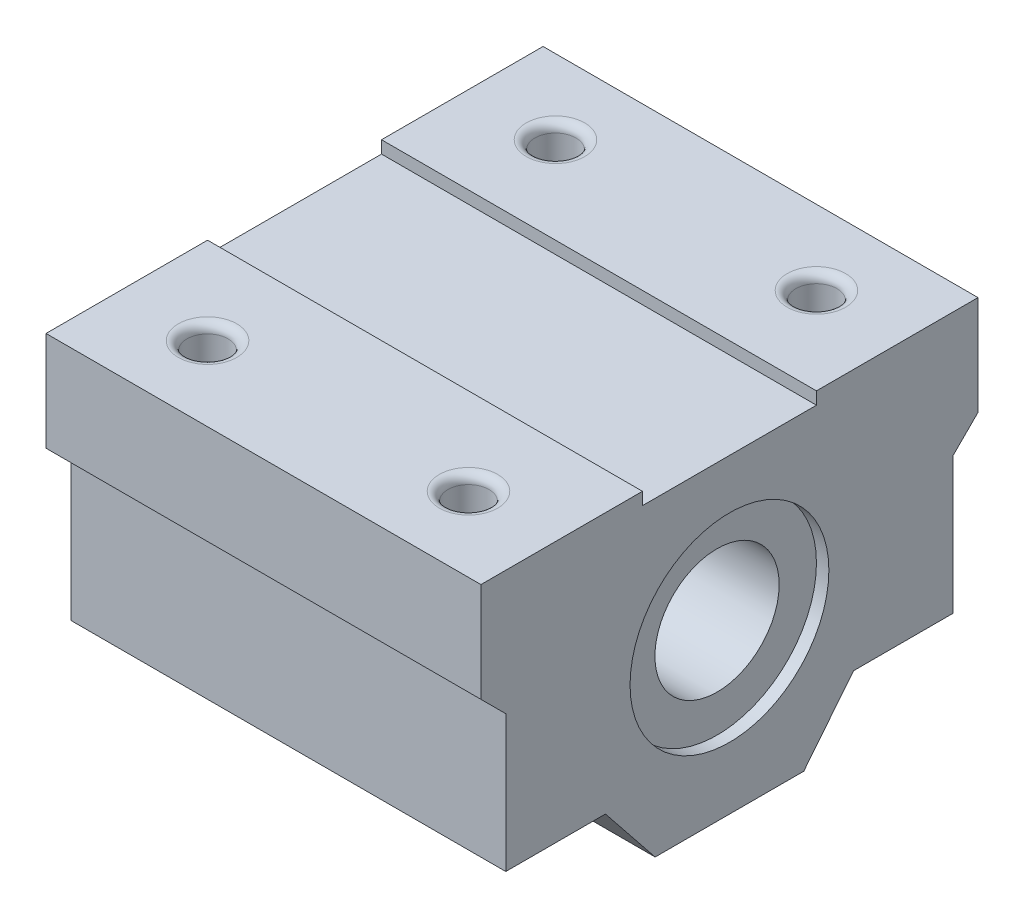
ISO-10303-21;
HEADER;
FILE_DESCRIPTION(('STEP AP214'),'2;1');
FILE_NAME('part.step','',(''),(''),'','','');
FILE_SCHEMA(('AUTOMOTIVE_DESIGN { 1 0 10303 214 1 1 1 1 }'));
ENDSEC;
DATA;
#1=APPLICATION_CONTEXT('core data for automotive mechanical design processes');
#2=APPLICATION_PROTOCOL_DEFINITION('international standard','automotive_design',2000,#1);
#3=PRODUCT_CONTEXT('',#1,'mechanical');
#4=PRODUCT('Part','Part','',(#3));
#5=PRODUCT_RELATED_PRODUCT_CATEGORY('part','',(#4));
#6=PRODUCT_DEFINITION_FORMATION('','',#4);
#7=PRODUCT_DEFINITION_CONTEXT('part definition',#1,'design');
#8=PRODUCT_DEFINITION('design','',#6,#7);
#9=PRODUCT_DEFINITION_SHAPE('','',#8);
#10=(LENGTH_UNIT() NAMED_UNIT(*) SI_UNIT(.MILLI.,.METRE.));
#11=(NAMED_UNIT(*) PLANE_ANGLE_UNIT() SI_UNIT($,.RADIAN.));
#12=(NAMED_UNIT(*) SI_UNIT($,.STERADIAN.) SOLID_ANGLE_UNIT());
#13=UNCERTAINTY_MEASURE_WITH_UNIT(LENGTH_MEASURE(1.E-05),#10,'distance_accuracy_value','');
#14=(GEOMETRIC_REPRESENTATION_CONTEXT(3) GLOBAL_UNCERTAINTY_ASSIGNED_CONTEXT((#13)) GLOBAL_UNIT_ASSIGNED_CONTEXT((#10,
#11,#12)) REPRESENTATION_CONTEXT('',''));
#15=CARTESIAN_POINT('',(0.,0.,0.));
#16=DIRECTION('',(0.,0.,1.));
#17=DIRECTION('',(1.,0.,0.));
#18=AXIS2_PLACEMENT_3D('',#15,#16,#17);
#19=CARTESIAN_POINT('',(-17.5,13.,0.));
#20=DIRECTION('',(1.,0.,0.));
#21=DIRECTION('',(0.,0.,-1.));
#22=AXIS2_PLACEMENT_3D('',#19,#20,#21);
#23=CYLINDRICAL_SURFACE('',#22,5.);
#24=CARTESIAN_POINT('',(16.5,13.,0.));
#25=DIRECTION('',(1.,0.,0.));
#26=DIRECTION('',(0.,0.,-1.));
#27=AXIS2_PLACEMENT_3D('',#24,#25,#26);
#28=CIRCLE('',#27,5.);
#29=CARTESIAN_POINT('',(16.5,13.,-4.99999999999999));
#30=VERTEX_POINT('',#29);
#31=EDGE_CURVE('E271',#30,#30,#28,.F.);
#32=ORIENTED_EDGE('',*,*,#31,.F.);
#33=EDGE_LOOP('',(#32));
#34=FACE_BOUND('',#33,.T.);
#35=CARTESIAN_POINT('',(-16.5,13.,0.));
#36=DIRECTION('',(-1.,0.,0.));
#37=DIRECTION('',(0.,0.,1.));
#38=AXIS2_PLACEMENT_3D('',#35,#36,#37);
#39=CIRCLE('',#38,5.);
#40=CARTESIAN_POINT('',(-16.5,13.,5.00000000000001));
#41=VERTEX_POINT('',#40);
#42=EDGE_CURVE('E38',#41,#41,#39,.F.);
#43=ORIENTED_EDGE('',*,*,#42,.F.);
#44=EDGE_LOOP('',(#43));
#45=FACE_BOUND('',#44,.T.);
#46=ADVANCED_FACE('F34',(#34,#45),#23,.F.);
#47=CARTESIAN_POINT('',(17.5,18.,20.));
#48=DIRECTION('',(0.,0.,-1.));
#49=DIRECTION('',(0.,1.,0.));
#50=AXIS2_PLACEMENT_3D('',#47,#48,#49);
#51=PLANE('',#50);
#52=DIRECTION('',(0.,-1.,0.));
#53=VECTOR('',#52,1.);
#54=CARTESIAN_POINT('',(-17.5,18.,20.));
#55=LINE('',#54,#53);
#56=CARTESIAN_POINT('',(-17.5,26.,20.));
#57=VERTEX_POINT('',#56);
#58=CARTESIAN_POINT('',(-17.5,18.,20.));
#59=VERTEX_POINT('',#58);
#60=EDGE_CURVE('E182',#57,#59,#55,.T.);
#61=ORIENTED_EDGE('',*,*,#60,.T.);
#62=DIRECTION('',(-1.,0.,0.));
#63=VECTOR('',#62,1.);
#64=CARTESIAN_POINT('',(17.5,18.,20.));
#65=LINE('',#64,#63);
#66=CARTESIAN_POINT('',(17.5,18.,20.));
#67=VERTEX_POINT('',#66);
#68=EDGE_CURVE('E250',#67,#59,#65,.T.);
#69=ORIENTED_EDGE('',*,*,#68,.F.);
#70=DIRECTION('',(0.,-1.,0.));
#71=VECTOR('',#70,1.);
#72=CARTESIAN_POINT('',(17.5,18.,20.));
#73=LINE('',#72,#71);
#74=CARTESIAN_POINT('',(17.5,26.,20.));
#75=VERTEX_POINT('',#74);
#76=EDGE_CURVE('E213',#75,#67,#73,.T.);
#77=ORIENTED_EDGE('',*,*,#76,.F.);
#78=DIRECTION('',(-1.,0.,0.));
#79=VECTOR('',#78,1.);
#80=CARTESIAN_POINT('',(17.5,26.,20.));
#81=LINE('',#80,#79);
#82=EDGE_CURVE('E178',#75,#57,#81,.T.);
#83=ORIENTED_EDGE('',*,*,#82,.T.);
#84=EDGE_LOOP('',(#61,#69,#77,#83));
#85=FACE_BOUND('',#84,.T.);
#86=ADVANCED_FACE('F335',(#85),#51,.F.);
#87=CARTESIAN_POINT('',(17.5,16.,18.));
#88=DIRECTION('',(0.,0.707106781186548,-0.707106781186548));
#89=DIRECTION('',(0.,0.707106781186548,0.707106781186548));
#90=AXIS2_PLACEMENT_3D('',#87,#88,#89);
#91=PLANE('',#90);
#92=DIRECTION('',(0.,-0.707106781186547,-0.707106781186547));
#93=VECTOR('',#92,1.);
#94=CARTESIAN_POINT('',(-17.5,16.,18.));
#95=LINE('',#94,#93);
#96=CARTESIAN_POINT('',(-17.5,16.,18.));
#97=VERTEX_POINT('',#96);
#98=EDGE_CURVE('E185',#59,#97,#95,.T.);
#99=ORIENTED_EDGE('',*,*,#98,.T.);
#100=DIRECTION('',(-1.,0.,0.));
#101=VECTOR('',#100,1.);
#102=CARTESIAN_POINT('',(17.5,16.,18.));
#103=LINE('',#102,#101);
#104=CARTESIAN_POINT('',(17.5,16.,18.));
#105=VERTEX_POINT('',#104);
#106=EDGE_CURVE('E247',#105,#97,#103,.T.);
#107=ORIENTED_EDGE('',*,*,#106,.F.);
#108=DIRECTION('',(0.,-0.707106781186547,-0.707106781186547));
#109=VECTOR('',#108,1.);
#110=CARTESIAN_POINT('',(17.5,16.,18.));
#111=LINE('',#110,#109);
#112=EDGE_CURVE('E121',#67,#105,#111,.T.);
#113=ORIENTED_EDGE('',*,*,#112,.F.);
#114=ORIENTED_EDGE('',*,*,#68,.T.);
#115=EDGE_LOOP('',(#99,#107,#113,#114));
#116=FACE_BOUND('',#115,.T.);
#117=ADVANCED_FACE('F356',(#116),#91,.F.);
#118=CARTESIAN_POINT('',(17.5,5.,18.));
#119=DIRECTION('',(0.,0.,-1.));
#120=DIRECTION('',(-1.,0.,0.));
#121=AXIS2_PLACEMENT_3D('',#118,#119,#120);
#122=PLANE('',#121);
#123=DIRECTION('',(0.,-1.,0.));
#124=VECTOR('',#123,1.);
#125=CARTESIAN_POINT('',(-17.5,5.,18.));
#126=LINE('',#125,#124);
#127=CARTESIAN_POINT('',(-17.5,5.,18.));
#128=VERTEX_POINT('',#127);
#129=EDGE_CURVE('E188',#97,#128,#126,.T.);
#130=ORIENTED_EDGE('',*,*,#129,.T.);
#131=DIRECTION('',(-1.,0.,0.));
#132=VECTOR('',#131,1.);
#133=CARTESIAN_POINT('',(17.5,5.,18.));
#134=LINE('',#133,#132);
#135=CARTESIAN_POINT('',(17.5,5.,18.));
#136=VERTEX_POINT('',#135);
#137=EDGE_CURVE('E244',#136,#128,#134,.T.);
#138=ORIENTED_EDGE('',*,*,#137,.F.);
#139=DIRECTION('',(0.,-1.,0.));
#140=VECTOR('',#139,1.);
#141=CARTESIAN_POINT('',(17.5,5.,18.));
#142=LINE('',#141,#140);
#143=EDGE_CURVE('E300',#105,#136,#142,.T.);
#144=ORIENTED_EDGE('',*,*,#143,.F.);
#145=ORIENTED_EDGE('',*,*,#106,.T.);
#146=EDGE_LOOP('',(#130,#138,#144,#145));
#147=FACE_BOUND('',#146,.T.);
#148=ADVANCED_FACE('F464',(#147),#122,.F.);
#149=CARTESIAN_POINT('',(17.5,5.,9.98012073410478));
#150=DIRECTION('',(0.,1.,0.));
#151=DIRECTION('',(0.,0.,1.));
#152=AXIS2_PLACEMENT_3D('',#149,#150,#151);
#153=PLANE('',#152);
#154=CARTESIAN_POINT('',(-10.5,5.,14.));
#155=DIRECTION('',(0.,1.,0.));
#156=DIRECTION('',(0.,0.,1.));
#157=AXIS2_PLACEMENT_3D('',#154,#155,#156);
#158=CIRCLE('',#157,1.65);
#159=CARTESIAN_POINT('',(-10.5,5.,15.65));
#160=VERTEX_POINT('',#159);
#161=EDGE_CURVE('E273',#160,#160,#158,.T.);
#162=ORIENTED_EDGE('',*,*,#161,.T.);
#163=EDGE_LOOP('',(#162));
#164=FACE_BOUND('',#163,.T.);
#165=CARTESIAN_POINT('',(10.5,5.,14.));
#166=DIRECTION('',(0.,1.,0.));
#167=DIRECTION('',(0.,0.,1.));
#168=AXIS2_PLACEMENT_3D('',#165,#166,#167);
#169=CIRCLE('',#168,1.65);
#170=CARTESIAN_POINT('',(10.5,5.,15.65));
#171=VERTEX_POINT('',#170);
#172=EDGE_CURVE('E278',#171,#171,#169,.T.);
#173=ORIENTED_EDGE('',*,*,#172,.T.);
#174=EDGE_LOOP('',(#173));
#175=FACE_BOUND('',#174,.T.);
#176=DIRECTION('',(0.,0.,-1.));
#177=VECTOR('',#176,1.);
#178=CARTESIAN_POINT('',(-17.5,5.,9.98012073410478));
#179=LINE('',#178,#177);
#180=CARTESIAN_POINT('',(-17.5,5.,9.98012073410478));
#181=VERTEX_POINT('',#180);
#182=EDGE_CURVE('E190',#128,#181,#179,.T.);
#183=ORIENTED_EDGE('',*,*,#182,.T.);
#184=DIRECTION('',(-1.,0.,0.));
#185=VECTOR('',#184,1.);
#186=CARTESIAN_POINT('',(17.5,5.,9.98012073410478));
#187=LINE('',#186,#185);
#188=CARTESIAN_POINT('',(17.5,5.,9.98012073410478));
#189=VERTEX_POINT('',#188);
#190=EDGE_CURVE('E241',#189,#181,#187,.T.);
#191=ORIENTED_EDGE('',*,*,#190,.F.);
#192=DIRECTION('',(0.,0.,-1.));
#193=VECTOR('',#192,1.);
#194=CARTESIAN_POINT('',(17.5,5.,9.98012073410478));
#195=LINE('',#194,#193);
#196=EDGE_CURVE('E302',#136,#189,#195,.T.);
#197=ORIENTED_EDGE('',*,*,#196,.F.);
#198=ORIENTED_EDGE('',*,*,#137,.T.);
#199=EDGE_LOOP('',(#183,#191,#197,#198));
#200=FACE_BOUND('',#199,.T.);
#201=ADVANCED_FACE('F460',(#164,#175,#200),#153,.F.);
#202=CARTESIAN_POINT('',(17.5,0.,5.98012073410478));
#203=DIRECTION('',(0.,0.624695047554424,-0.78086880944303));
#204=DIRECTION('',(0.,0.78086880944303,0.624695047554424));
#205=AXIS2_PLACEMENT_3D('',#202,#203,#204);
#206=PLANE('',#205);
#207=DIRECTION('',(0.,-0.78086880944303,-0.624695047554424));
#208=VECTOR('',#207,1.);
#209=CARTESIAN_POINT('',(-17.5,0.,5.98012073410478));
#210=LINE('',#209,#208);
#211=CARTESIAN_POINT('',(-17.5,0.,5.98012073410478));
#212=VERTEX_POINT('',#211);
#213=EDGE_CURVE('E192',#181,#212,#210,.T.);
#214=ORIENTED_EDGE('',*,*,#213,.T.);
#215=DIRECTION('',(-1.,0.,0.));
#216=VECTOR('',#215,1.);
#217=CARTESIAN_POINT('',(17.5,0.,5.98012073410478));
#218=LINE('',#217,#216);
#219=CARTESIAN_POINT('',(17.5,0.,5.98012073410478));
#220=VERTEX_POINT('',#219);
#221=EDGE_CURVE('E238',#220,#212,#218,.T.);
#222=ORIENTED_EDGE('',*,*,#221,.F.);
#223=DIRECTION('',(0.,-0.78086880944303,-0.624695047554424));
#224=VECTOR('',#223,1.);
#225=CARTESIAN_POINT('',(17.5,0.,5.98012073410478));
#226=LINE('',#225,#224);
#227=EDGE_CURVE('E304',#189,#220,#226,.T.);
#228=ORIENTED_EDGE('',*,*,#227,.F.);
#229=ORIENTED_EDGE('',*,*,#190,.T.);
#230=EDGE_LOOP('',(#214,#222,#228,#229));
#231=FACE_BOUND('',#230,.T.);
#232=ADVANCED_FACE('F456',(#231),#206,.F.);
#233=CARTESIAN_POINT('',(17.5,0.,5.98012073410478));
#234=DIRECTION('',(0.,1.,0.));
#235=DIRECTION('',(0.,0.,1.));
#236=AXIS2_PLACEMENT_3D('',#233,#234,#235);
#237=PLANE('',#236);
#238=DIRECTION('',(0.,0.,-1.));
#239=VECTOR('',#238,1.);
#240=CARTESIAN_POINT('',(-17.5,0.,5.98012073410478));
#241=LINE('',#240,#239);
#242=CARTESIAN_POINT('',(-17.5,0.,-5.98012073410478));
#243=VERTEX_POINT('',#242);
#244=EDGE_CURVE('E194',#212,#243,#241,.T.);
#245=ORIENTED_EDGE('',*,*,#244,.T.);
#246=DIRECTION('',(-1.,0.,0.));
#247=VECTOR('',#246,1.);
#248=CARTESIAN_POINT('',(17.5,0.,-5.98012073410478));
#249=LINE('',#248,#247);
#250=CARTESIAN_POINT('',(17.5,0.,-5.98012073410478));
#251=VERTEX_POINT('',#250);
#252=EDGE_CURVE('E235',#251,#243,#249,.T.);
#253=ORIENTED_EDGE('',*,*,#252,.F.);
#254=DIRECTION('',(0.,0.,-1.));
#255=VECTOR('',#254,1.);
#256=CARTESIAN_POINT('',(17.5,0.,5.98012073410478));
#257=LINE('',#256,#255);
#258=EDGE_CURVE('E306',#220,#251,#257,.T.);
#259=ORIENTED_EDGE('',*,*,#258,.F.);
#260=ORIENTED_EDGE('',*,*,#221,.T.);
#261=EDGE_LOOP('',(#245,#253,#259,#260));
#262=FACE_BOUND('',#261,.T.);
#263=ADVANCED_FACE('F452',(#262),#237,.F.);
#264=CARTESIAN_POINT('',(17.5,0.,-5.98012073410478));
#265=DIRECTION('',(0.,0.624695047554424,0.78086880944303));
#266=DIRECTION('',(0.,-0.78086880944303,0.624695047554424));
#267=AXIS2_PLACEMENT_3D('',#264,#265,#266);
#268=PLANE('',#267);
#269=DIRECTION('',(0.,0.78086880944303,-0.624695047554425));
#270=VECTOR('',#269,1.);
#271=CARTESIAN_POINT('',(-17.5,0.,-5.98012073410478));
#272=LINE('',#271,#270);
#273=CARTESIAN_POINT('',(-17.5,5.,-9.98012073410478));
#274=VERTEX_POINT('',#273);
#275=EDGE_CURVE('E196',#243,#274,#272,.T.);
#276=ORIENTED_EDGE('',*,*,#275,.T.);
#277=DIRECTION('',(-1.,0.,0.));
#278=VECTOR('',#277,1.);
#279=CARTESIAN_POINT('',(17.5,5.,-9.98012073410478));
#280=LINE('',#279,#278);
#281=CARTESIAN_POINT('',(17.5,5.,-9.98012073410478));
#282=VERTEX_POINT('',#281);
#283=EDGE_CURVE('E232',#282,#274,#280,.T.);
#284=ORIENTED_EDGE('',*,*,#283,.F.);
#285=DIRECTION('',(0.,0.78086880944303,-0.624695047554425));
#286=VECTOR('',#285,1.);
#287=CARTESIAN_POINT('',(17.5,0.,-5.98012073410478));
#288=LINE('',#287,#286);
#289=EDGE_CURVE('E308',#251,#282,#288,.T.);
#290=ORIENTED_EDGE('',*,*,#289,.F.);
#291=ORIENTED_EDGE('',*,*,#252,.T.);
#292=EDGE_LOOP('',(#276,#284,#290,#291));
#293=FACE_BOUND('',#292,.T.);
#294=ADVANCED_FACE('F416',(#293),#268,.F.);
#295=CARTESIAN_POINT('',(17.5,5.,-9.98012073410478));
#296=DIRECTION('',(0.,1.,0.));
#297=DIRECTION('',(0.,0.,1.));
#298=AXIS2_PLACEMENT_3D('',#295,#296,#297);
#299=PLANE('',#298);
#300=CARTESIAN_POINT('',(10.5,5.,-14.));
#301=DIRECTION('',(0.,1.,0.));
#302=DIRECTION('',(0.,0.,1.));
#303=AXIS2_PLACEMENT_3D('',#300,#301,#302);
#304=CIRCLE('',#303,1.65);
#305=CARTESIAN_POINT('',(10.5,5.,-12.35));
#306=VERTEX_POINT('',#305);
#307=EDGE_CURVE('E293',#306,#306,#304,.T.);
#308=ORIENTED_EDGE('',*,*,#307,.T.);
#309=EDGE_LOOP('',(#308));
#310=FACE_BOUND('',#309,.T.);
#311=CARTESIAN_POINT('',(-10.5,5.,-14.));
#312=DIRECTION('',(0.,1.,0.));
#313=DIRECTION('',(0.,0.,1.));
#314=AXIS2_PLACEMENT_3D('',#311,#312,#313);
#315=CIRCLE('',#314,1.65);
#316=CARTESIAN_POINT('',(-10.5,5.,-12.35));
#317=VERTEX_POINT('',#316);
#318=EDGE_CURVE('E186',#317,#317,#315,.T.);
#319=ORIENTED_EDGE('',*,*,#318,.T.);
#320=EDGE_LOOP('',(#319));
#321=FACE_BOUND('',#320,.T.);
#322=DIRECTION('',(0.,0.,-1.));
#323=VECTOR('',#322,1.);
#324=CARTESIAN_POINT('',(-17.5,5.,-9.98012073410478));
#325=LINE('',#324,#323);
#326=CARTESIAN_POINT('',(-17.5,5.,-18.));
#327=VERTEX_POINT('',#326);
#328=EDGE_CURVE('E198',#274,#327,#325,.T.);
#329=ORIENTED_EDGE('',*,*,#328,.T.);
#330=DIRECTION('',(-1.,0.,0.));
#331=VECTOR('',#330,1.);
#332=CARTESIAN_POINT('',(17.5,5.,-18.));
#333=LINE('',#332,#331);
#334=CARTESIAN_POINT('',(17.5,5.,-18.));
#335=VERTEX_POINT('',#334);
#336=EDGE_CURVE('E229',#335,#327,#333,.T.);
#337=ORIENTED_EDGE('',*,*,#336,.F.);
#338=DIRECTION('',(0.,0.,-1.));
#339=VECTOR('',#338,1.);
#340=CARTESIAN_POINT('',(17.5,5.,-9.98012073410478));
#341=LINE('',#340,#339);
#342=EDGE_CURVE('E310',#282,#335,#341,.T.);
#343=ORIENTED_EDGE('',*,*,#342,.F.);
#344=ORIENTED_EDGE('',*,*,#283,.T.);
#345=EDGE_LOOP('',(#329,#337,#343,#344));
#346=FACE_BOUND('',#345,.T.);
#347=ADVANCED_FACE('F412',(#310,#321,#346),#299,.F.);
#348=CARTESIAN_POINT('',(17.5,5.,-18.));
#349=DIRECTION('',(0.,0.,1.));
#350=DIRECTION('',(1.,0.,0.));
#351=AXIS2_PLACEMENT_3D('',#348,#349,#350);
#352=PLANE('',#351);
#353=DIRECTION('',(0.,1.,0.));
#354=VECTOR('',#353,1.);
#355=CARTESIAN_POINT('',(-17.5,5.,-18.));
#356=LINE('',#355,#354);
#357=CARTESIAN_POINT('',(-17.5,16.,-18.));
#358=VERTEX_POINT('',#357);
#359=EDGE_CURVE('E200',#327,#358,#356,.T.);
#360=ORIENTED_EDGE('',*,*,#359,.T.);
#361=DIRECTION('',(-1.,0.,0.));
#362=VECTOR('',#361,1.);
#363=CARTESIAN_POINT('',(17.5,16.,-18.));
#364=LINE('',#363,#362);
#365=CARTESIAN_POINT('',(17.5,16.,-18.));
#366=VERTEX_POINT('',#365);
#367=EDGE_CURVE('E226',#366,#358,#364,.T.);
#368=ORIENTED_EDGE('',*,*,#367,.F.);
#369=DIRECTION('',(0.,1.,0.));
#370=VECTOR('',#369,1.);
#371=CARTESIAN_POINT('',(17.5,5.,-18.));
#372=LINE('',#371,#370);
#373=EDGE_CURVE('E312',#335,#366,#372,.T.);
#374=ORIENTED_EDGE('',*,*,#373,.F.);
#375=ORIENTED_EDGE('',*,*,#336,.T.);
#376=EDGE_LOOP('',(#360,#368,#374,#375));
#377=FACE_BOUND('',#376,.T.);
#378=ADVANCED_FACE('F415',(#377),#352,.F.);
#379=CARTESIAN_POINT('',(17.5,16.,-18.));
#380=DIRECTION('',(0.,0.707106781186548,0.707106781186547));
#381=DIRECTION('',(0.,-0.707106781186547,0.707106781186548));
#382=AXIS2_PLACEMENT_3D('',#379,#380,#381);
#383=PLANE('',#382);
#384=DIRECTION('',(0.,0.707106781186547,-0.707106781186548));
#385=VECTOR('',#384,1.);
#386=CARTESIAN_POINT('',(-17.5,16.,-18.));
#387=LINE('',#386,#385);
#388=CARTESIAN_POINT('',(-17.5,18.,-20.));
#389=VERTEX_POINT('',#388);
#390=EDGE_CURVE('E202',#358,#389,#387,.T.);
#391=ORIENTED_EDGE('',*,*,#390,.T.);
#392=DIRECTION('',(-1.,0.,0.));
#393=VECTOR('',#392,1.);
#394=CARTESIAN_POINT('',(17.5,18.,-20.));
#395=LINE('',#394,#393);
#396=CARTESIAN_POINT('',(17.5,18.,-20.));
#397=VERTEX_POINT('',#396);
#398=EDGE_CURVE('E223',#397,#389,#395,.T.);
#399=ORIENTED_EDGE('',*,*,#398,.F.);
#400=DIRECTION('',(0.,0.707106781186547,-0.707106781186548));
#401=VECTOR('',#400,1.);
#402=CARTESIAN_POINT('',(17.5,16.,-18.));
#403=LINE('',#402,#401);
#404=EDGE_CURVE('E314',#366,#397,#403,.T.);
#405=ORIENTED_EDGE('',*,*,#404,.F.);
#406=ORIENTED_EDGE('',*,*,#367,.T.);
#407=EDGE_LOOP('',(#391,#399,#405,#406));
#408=FACE_BOUND('',#407,.T.);
#409=ADVANCED_FACE('F433',(#408),#383,.F.);
#410=CARTESIAN_POINT('',(17.5,18.,-20.));
#411=DIRECTION('',(0.,0.,1.));
#412=DIRECTION('',(1.,0.,0.));
#413=AXIS2_PLACEMENT_3D('',#410,#411,#412);
#414=PLANE('',#413);
#415=DIRECTION('',(0.,1.,0.));
#416=VECTOR('',#415,1.);
#417=CARTESIAN_POINT('',(-17.5,18.,-20.));
#418=LINE('',#417,#416);
#419=CARTESIAN_POINT('',(-17.5,26.,-20.));
#420=VERTEX_POINT('',#419);
#421=EDGE_CURVE('E204',#389,#420,#418,.T.);
#422=ORIENTED_EDGE('',*,*,#421,.T.);
#423=DIRECTION('',(-1.,0.,0.));
#424=VECTOR('',#423,1.);
#425=CARTESIAN_POINT('',(17.5,26.,-20.));
#426=LINE('',#425,#424);
#427=CARTESIAN_POINT('',(17.5,26.,-20.));
#428=VERTEX_POINT('',#427);
#429=EDGE_CURVE('E220',#428,#420,#426,.T.);
#430=ORIENTED_EDGE('',*,*,#429,.F.);
#431=DIRECTION('',(0.,1.,0.));
#432=VECTOR('',#431,1.);
#433=CARTESIAN_POINT('',(17.5,18.,-20.));
#434=LINE('',#433,#432);
#435=EDGE_CURVE('E316',#397,#428,#434,.T.);
#436=ORIENTED_EDGE('',*,*,#435,.F.);
#437=ORIENTED_EDGE('',*,*,#398,.T.);
#438=EDGE_LOOP('',(#422,#430,#436,#437));
#439=FACE_BOUND('',#438,.T.);
#440=ADVANCED_FACE('F436',(#439),#414,.F.);
#441=CARTESIAN_POINT('',(17.5,26.,-7.));
#442=DIRECTION('',(0.,-1.,0.));
#443=DIRECTION('',(0.,0.,-1.));
#444=AXIS2_PLACEMENT_3D('',#441,#442,#443);
#445=PLANE('',#444);
#446=CARTESIAN_POINT('',(-10.5,26.,-14.));
#447=DIRECTION('',(0.,-1.,0.));
#448=DIRECTION('',(0.,0.,-1.));
#449=AXIS2_PLACEMENT_3D('',#446,#447,#448);
#450=CIRCLE('',#449,2.35);
#451=CARTESIAN_POINT('',(-10.5,26.,-16.35));
#452=VERTEX_POINT('',#451);
#453=EDGE_CURVE('E258',#452,#452,#450,.T.);
#454=ORIENTED_EDGE('',*,*,#453,.T.);
#455=EDGE_LOOP('',(#454));
#456=FACE_BOUND('',#455,.T.);
#457=CARTESIAN_POINT('',(10.5,26.,-14.));
#458=DIRECTION('',(0.,-1.,0.));
#459=DIRECTION('',(0.,0.,-1.));
#460=AXIS2_PLACEMENT_3D('',#457,#458,#459);
#461=CIRCLE('',#460,2.35);
#462=CARTESIAN_POINT('',(10.5,26.,-16.35));
#463=VERTEX_POINT('',#462);
#464=EDGE_CURVE('E255',#463,#463,#461,.T.);
#465=ORIENTED_EDGE('',*,*,#464,.T.);
#466=EDGE_LOOP('',(#465));
#467=FACE_BOUND('',#466,.T.);
#468=DIRECTION('',(0.,0.,1.));
#469=VECTOR('',#468,1.);
#470=CARTESIAN_POINT('',(-17.5,26.,-7.));
#471=LINE('',#470,#469);
#472=CARTESIAN_POINT('',(-17.5,26.,-7.));
#473=VERTEX_POINT('',#472);
#474=EDGE_CURVE('E206',#420,#473,#471,.T.);
#475=ORIENTED_EDGE('',*,*,#474,.T.);
#476=DIRECTION('',(-1.,0.,0.));
#477=VECTOR('',#476,1.);
#478=CARTESIAN_POINT('',(17.5,26.,-7.));
#479=LINE('',#478,#477);
#480=CARTESIAN_POINT('',(17.5,26.,-7.));
#481=VERTEX_POINT('',#480);
#482=EDGE_CURVE('E217',#481,#473,#479,.T.);
#483=ORIENTED_EDGE('',*,*,#482,.F.);
#484=DIRECTION('',(0.,0.,1.));
#485=VECTOR('',#484,1.);
#486=CARTESIAN_POINT('',(17.5,26.,-7.));
#487=LINE('',#486,#485);
#488=EDGE_CURVE('E318',#428,#481,#487,.T.);
#489=ORIENTED_EDGE('',*,*,#488,.F.);
#490=ORIENTED_EDGE('',*,*,#429,.T.);
#491=EDGE_LOOP('',(#475,#483,#489,#490));
#492=FACE_BOUND('',#491,.T.);
#493=ADVANCED_FACE('F324',(#456,#467,#492),#445,.F.);
#494=CARTESIAN_POINT('',(17.5,25.,-7.));
#495=DIRECTION('',(0.,0.,-1.));
#496=DIRECTION('',(-1.,0.,0.));
#497=AXIS2_PLACEMENT_3D('',#494,#495,#496);
#498=PLANE('',#497);
#499=DIRECTION('',(0.,-1.,0.));
#500=VECTOR('',#499,1.);
#501=CARTESIAN_POINT('',(-17.5,25.,-7.));
#502=LINE('',#501,#500);
#503=CARTESIAN_POINT('',(-17.5,25.,-7.));
#504=VERTEX_POINT('',#503);
#505=EDGE_CURVE('E208',#473,#504,#502,.T.);
#506=ORIENTED_EDGE('',*,*,#505,.T.);
#507=DIRECTION('',(-1.,0.,0.));
#508=VECTOR('',#507,1.);
#509=CARTESIAN_POINT('',(17.5,25.,-7.));
#510=LINE('',#509,#508);
#511=CARTESIAN_POINT('',(17.5,25.,-7.));
#512=VERTEX_POINT('',#511);
#513=EDGE_CURVE('E173',#512,#504,#510,.T.);
#514=ORIENTED_EDGE('',*,*,#513,.F.);
#515=DIRECTION('',(0.,-1.,0.));
#516=VECTOR('',#515,1.);
#517=CARTESIAN_POINT('',(17.5,25.,-7.));
#518=LINE('',#517,#516);
#519=EDGE_CURVE('E164',#481,#512,#518,.T.);
#520=ORIENTED_EDGE('',*,*,#519,.F.);
#521=ORIENTED_EDGE('',*,*,#482,.T.);
#522=EDGE_LOOP('',(#506,#514,#520,#521));
#523=FACE_BOUND('',#522,.T.);
#524=ADVANCED_FACE('F328',(#523),#498,.F.);
#525=CARTESIAN_POINT('',(17.5,25.,7.));
#526=DIRECTION('',(0.,-1.,0.));
#527=DIRECTION('',(0.,0.,-1.));
#528=AXIS2_PLACEMENT_3D('',#525,#526,#527);
#529=PLANE('',#528);
#530=DIRECTION('',(0.,0.,1.));
#531=VECTOR('',#530,1.);
#532=CARTESIAN_POINT('',(-17.5,25.,7.));
#533=LINE('',#532,#531);
#534=CARTESIAN_POINT('',(-17.5,25.,7.));
#535=VERTEX_POINT('',#534);
#536=EDGE_CURVE('E172',#504,#535,#533,.T.);
#537=ORIENTED_EDGE('',*,*,#536,.T.);
#538=DIRECTION('',(-1.,0.,0.));
#539=VECTOR('',#538,1.);
#540=CARTESIAN_POINT('',(17.5,25.,7.));
#541=LINE('',#540,#539);
#542=CARTESIAN_POINT('',(17.5,25.,7.));
#543=VERTEX_POINT('',#542);
#544=EDGE_CURVE('E169',#543,#535,#541,.T.);
#545=ORIENTED_EDGE('',*,*,#544,.F.);
#546=DIRECTION('',(0.,0.,1.));
#547=VECTOR('',#546,1.);
#548=CARTESIAN_POINT('',(17.5,25.,7.));
#549=LINE('',#548,#547);
#550=EDGE_CURVE('E158',#512,#543,#549,.T.);
#551=ORIENTED_EDGE('',*,*,#550,.F.);
#552=ORIENTED_EDGE('',*,*,#513,.T.);
#553=EDGE_LOOP('',(#537,#545,#551,#552));
#554=FACE_BOUND('',#553,.T.);
#555=ADVANCED_FACE('F170',(#554),#529,.F.);
#556=CARTESIAN_POINT('',(17.5,25.,7.));
#557=DIRECTION('',(0.,0.,1.));
#558=DIRECTION('',(1.,0.,0.));
#559=AXIS2_PLACEMENT_3D('',#556,#557,#558);
#560=PLANE('',#559);
#561=DIRECTION('',(0.,1.,0.));
#562=VECTOR('',#561,1.);
#563=CARTESIAN_POINT('',(-17.5,25.,7.));
#564=LINE('',#563,#562);
#565=CARTESIAN_POINT('',(-17.5,26.,7.));
#566=VERTEX_POINT('',#565);
#567=EDGE_CURVE('E106',#535,#566,#564,.T.);
#568=ORIENTED_EDGE('',*,*,#567,.T.);
#569=DIRECTION('',(-1.,0.,0.));
#570=VECTOR('',#569,1.);
#571=CARTESIAN_POINT('',(17.5,26.,7.));
#572=LINE('',#571,#570);
#573=CARTESIAN_POINT('',(17.5,26.,7.));
#574=VERTEX_POINT('',#573);
#575=EDGE_CURVE('E174',#574,#566,#572,.T.);
#576=ORIENTED_EDGE('',*,*,#575,.F.);
#577=DIRECTION('',(0.,1.,0.));
#578=VECTOR('',#577,1.);
#579=CARTESIAN_POINT('',(17.5,25.,7.));
#580=LINE('',#579,#578);
#581=EDGE_CURVE('E162',#543,#574,#580,.T.);
#582=ORIENTED_EDGE('',*,*,#581,.F.);
#583=ORIENTED_EDGE('',*,*,#544,.T.);
#584=EDGE_LOOP('',(#568,#576,#582,#583));
#585=FACE_BOUND('',#584,.T.);
#586=ADVANCED_FACE('F176',(#585),#560,.F.);
#587=CARTESIAN_POINT('',(17.5,26.,20.));
#588=DIRECTION('',(0.,-1.,0.));
#589=DIRECTION('',(0.,0.,-1.));
#590=AXIS2_PLACEMENT_3D('',#587,#588,#589);
#591=PLANE('',#590);
#592=CARTESIAN_POINT('',(10.5,26.,14.));
#593=DIRECTION('',(0.,-1.,0.));
#594=DIRECTION('',(0.,0.,-1.));
#595=AXIS2_PLACEMENT_3D('',#592,#593,#594);
#596=CIRCLE('',#595,2.35);
#597=CARTESIAN_POINT('',(10.5,26.,11.65));
#598=VERTEX_POINT('',#597);
#599=EDGE_CURVE('E44',#598,#598,#596,.T.);
#600=ORIENTED_EDGE('',*,*,#599,.T.);
#601=EDGE_LOOP('',(#600));
#602=FACE_BOUND('',#601,.T.);
#603=CARTESIAN_POINT('',(-10.5,26.,14.));
#604=DIRECTION('',(0.,-1.,0.));
#605=DIRECTION('',(0.,0.,-1.));
#606=AXIS2_PLACEMENT_3D('',#603,#604,#605);
#607=CIRCLE('',#606,2.35);
#608=CARTESIAN_POINT('',(-10.5,26.,11.65));
#609=VERTEX_POINT('',#608);
#610=EDGE_CURVE('E267',#609,#609,#607,.T.);
#611=ORIENTED_EDGE('',*,*,#610,.T.);
#612=EDGE_LOOP('',(#611));
#613=FACE_BOUND('',#612,.T.);
#614=DIRECTION('',(0.,0.,1.));
#615=VECTOR('',#614,1.);
#616=CARTESIAN_POINT('',(-17.5,26.,20.));
#617=LINE('',#616,#615);
#618=EDGE_CURVE('E112',#566,#57,#617,.T.);
#619=ORIENTED_EDGE('',*,*,#618,.T.);
#620=ORIENTED_EDGE('',*,*,#82,.F.);
#621=DIRECTION('',(0.,0.,1.));
#622=VECTOR('',#621,1.);
#623=CARTESIAN_POINT('',(17.5,26.,20.));
#624=LINE('',#623,#622);
#625=EDGE_CURVE('E53',#574,#75,#624,.T.);
#626=ORIENTED_EDGE('',*,*,#625,.F.);
#627=ORIENTED_EDGE('',*,*,#575,.T.);
#628=EDGE_LOOP('',(#619,#620,#626,#627));
#629=FACE_BOUND('',#628,.T.);
#630=ADVANCED_FACE('F337',(#602,#613,#629),#591,.F.);
#631=CARTESIAN_POINT('',(17.5,26.,20.));
#632=DIRECTION('',(-1.,0.,0.));
#633=DIRECTION('',(0.,0.,1.));
#634=AXIS2_PLACEMENT_3D('',#631,#632,#633);
#635=PLANE('',#634);
#636=CARTESIAN_POINT('',(17.5,13.,0.));
#637=DIRECTION('',(1.,0.,0.));
#638=DIRECTION('',(0.,0.,-1.));
#639=AXIS2_PLACEMENT_3D('',#636,#637,#638);
#640=CIRCLE('',#639,8.);
#641=CARTESIAN_POINT('',(17.5,13.,-7.99999999999999));
#642=VERTEX_POINT('',#641);
#643=EDGE_CURVE('E281',#642,#642,#640,.T.);
#644=ORIENTED_EDGE('',*,*,#643,.F.);
#645=EDGE_LOOP('',(#644));
#646=FACE_BOUND('',#645,.T.);
#647=ORIENTED_EDGE('',*,*,#76,.T.);
#648=ORIENTED_EDGE('',*,*,#112,.T.);
#649=ORIENTED_EDGE('',*,*,#143,.T.);
#650=ORIENTED_EDGE('',*,*,#196,.T.);
#651=ORIENTED_EDGE('',*,*,#227,.T.);
#652=ORIENTED_EDGE('',*,*,#258,.T.);
#653=ORIENTED_EDGE('',*,*,#289,.T.);
#654=ORIENTED_EDGE('',*,*,#342,.T.);
#655=ORIENTED_EDGE('',*,*,#373,.T.);
#656=ORIENTED_EDGE('',*,*,#404,.T.);
#657=ORIENTED_EDGE('',*,*,#435,.T.);
#658=ORIENTED_EDGE('',*,*,#488,.T.);
#659=ORIENTED_EDGE('',*,*,#519,.T.);
#660=ORIENTED_EDGE('',*,*,#550,.T.);
#661=ORIENTED_EDGE('',*,*,#581,.T.);
#662=ORIENTED_EDGE('',*,*,#625,.T.);
#663=EDGE_LOOP('',(#647,#648,#649,#650,#651,#652,#653,#654,#655,#656,#657,#658,#659,#660,#661,#662));
#664=FACE_BOUND('',#663,.T.);
#665=ADVANCED_FACE('F160',(#646,#664),#635,.F.);
#666=CARTESIAN_POINT('',(-17.5,26.,20.));
#667=DIRECTION('',(-1.,0.,0.));
#668=DIRECTION('',(0.,0.,1.));
#669=AXIS2_PLACEMENT_3D('',#666,#667,#668);
#670=PLANE('',#669);
#671=CARTESIAN_POINT('',(-17.5,13.,0.));
#672=DIRECTION('',(1.,0.,0.));
#673=DIRECTION('',(0.,0.,-1.));
#674=AXIS2_PLACEMENT_3D('',#671,#672,#673);
#675=CIRCLE('',#674,8.);
#676=CARTESIAN_POINT('',(-17.5,13.,-7.99999999999999));
#677=VERTEX_POINT('',#676);
#678=EDGE_CURVE('E288',#677,#677,#675,.T.);
#679=ORIENTED_EDGE('',*,*,#678,.T.);
#680=EDGE_LOOP('',(#679));
#681=FACE_BOUND('',#680,.T.);
#682=ORIENTED_EDGE('',*,*,#60,.F.);
#683=ORIENTED_EDGE('',*,*,#618,.F.);
#684=ORIENTED_EDGE('',*,*,#567,.F.);
#685=ORIENTED_EDGE('',*,*,#536,.F.);
#686=ORIENTED_EDGE('',*,*,#505,.F.);
#687=ORIENTED_EDGE('',*,*,#474,.F.);
#688=ORIENTED_EDGE('',*,*,#421,.F.);
#689=ORIENTED_EDGE('',*,*,#390,.F.);
#690=ORIENTED_EDGE('',*,*,#359,.F.);
#691=ORIENTED_EDGE('',*,*,#328,.F.);
#692=ORIENTED_EDGE('',*,*,#275,.F.);
#693=ORIENTED_EDGE('',*,*,#244,.F.);
#694=ORIENTED_EDGE('',*,*,#213,.F.);
#695=ORIENTED_EDGE('',*,*,#182,.F.);
#696=ORIENTED_EDGE('',*,*,#129,.F.);
#697=ORIENTED_EDGE('',*,*,#98,.F.);
#698=EDGE_LOOP('',(#682,#683,#684,#685,#686,#687,#688,#689,#690,#691,#692,#693,#694,#695,#696,#697));
#699=FACE_BOUND('',#698,.T.);
#700=ADVANCED_FACE('F331',(#681,#699),#670,.T.);
#701=CARTESIAN_POINT('',(-10.5,0.,-14.));
#702=DIRECTION('',(0.,1.,0.));
#703=DIRECTION('',(0.,0.,1.));
#704=AXIS2_PLACEMENT_3D('',#701,#702,#703);
#705=CYLINDRICAL_SURFACE('',#704,1.65);
#706=CARTESIAN_POINT('',(-10.5,25.3,-14.));
#707=DIRECTION('',(0.,-1.,0.));
#708=DIRECTION('',(0.,0.,-1.));
#709=AXIS2_PLACEMENT_3D('',#706,#707,#708);
#710=CIRCLE('',#709,1.65);
#711=CARTESIAN_POINT('',(-10.5,25.3,-15.65));
#712=VERTEX_POINT('',#711);
#713=EDGE_CURVE('E252',#712,#712,#710,.F.);
#714=ORIENTED_EDGE('',*,*,#713,.T.);
#715=EDGE_LOOP('',(#714));
#716=FACE_BOUND('',#715,.T.);
#717=ORIENTED_EDGE('',*,*,#318,.F.);
#718=EDGE_LOOP('',(#717));
#719=FACE_BOUND('',#718,.T.);
#720=ADVANCED_FACE('F360',(#716,#719),#705,.F.);
#721=CARTESIAN_POINT('',(10.5,0.,-14.));
#722=DIRECTION('',(0.,1.,0.));
#723=DIRECTION('',(0.,0.,1.));
#724=AXIS2_PLACEMENT_3D('',#721,#722,#723);
#725=CYLINDRICAL_SURFACE('',#724,1.65);
#726=CARTESIAN_POINT('',(10.5,25.3,-14.));
#727=DIRECTION('',(0.,-1.,0.));
#728=DIRECTION('',(0.,0.,-1.));
#729=AXIS2_PLACEMENT_3D('',#726,#727,#728);
#730=CIRCLE('',#729,1.65);
#731=CARTESIAN_POINT('',(10.5,25.3,-15.65));
#732=VERTEX_POINT('',#731);
#733=EDGE_CURVE('E261',#732,#732,#730,.F.);
#734=ORIENTED_EDGE('',*,*,#733,.T.);
#735=EDGE_LOOP('',(#734));
#736=FACE_BOUND('',#735,.T.);
#737=ORIENTED_EDGE('',*,*,#307,.F.);
#738=EDGE_LOOP('',(#737));
#739=FACE_BOUND('',#738,.T.);
#740=ADVANCED_FACE('F367',(#736,#739),#725,.F.);
#741=CARTESIAN_POINT('',(10.5,0.,14.));
#742=DIRECTION('',(0.,1.,0.));
#743=DIRECTION('',(0.,0.,1.));
#744=AXIS2_PLACEMENT_3D('',#741,#742,#743);
#745=CYLINDRICAL_SURFACE('',#744,1.65);
#746=CARTESIAN_POINT('',(10.5,25.3,14.));
#747=DIRECTION('',(0.,-1.,0.));
#748=DIRECTION('',(0.,0.,-1.));
#749=AXIS2_PLACEMENT_3D('',#746,#747,#748);
#750=CIRCLE('',#749,1.65);
#751=CARTESIAN_POINT('',(10.5,25.3,12.35));
#752=VERTEX_POINT('',#751);
#753=EDGE_CURVE('E264',#752,#752,#750,.F.);
#754=ORIENTED_EDGE('',*,*,#753,.T.);
#755=EDGE_LOOP('',(#754));
#756=FACE_BOUND('',#755,.T.);
#757=ORIENTED_EDGE('',*,*,#172,.F.);
#758=EDGE_LOOP('',(#757));
#759=FACE_BOUND('',#758,.T.);
#760=ADVANCED_FACE('F400',(#756,#759),#745,.F.);
#761=CARTESIAN_POINT('',(-10.5,0.,14.));
#762=DIRECTION('',(0.,1.,0.));
#763=DIRECTION('',(0.,0.,1.));
#764=AXIS2_PLACEMENT_3D('',#761,#762,#763);
#765=CYLINDRICAL_SURFACE('',#764,1.65);
#766=CARTESIAN_POINT('',(-10.5,25.3,14.));
#767=DIRECTION('',(0.,-1.,0.));
#768=DIRECTION('',(0.,0.,-1.));
#769=AXIS2_PLACEMENT_3D('',#766,#767,#768);
#770=CIRCLE('',#769,1.65);
#771=CARTESIAN_POINT('',(-10.5,25.3,12.35));
#772=VERTEX_POINT('',#771);
#773=EDGE_CURVE('E11',#772,#772,#770,.F.);
#774=ORIENTED_EDGE('',*,*,#773,.T.);
#775=EDGE_LOOP('',(#774));
#776=FACE_BOUND('',#775,.T.);
#777=ORIENTED_EDGE('',*,*,#161,.F.);
#778=EDGE_LOOP('',(#777));
#779=FACE_BOUND('',#778,.T.);
#780=ADVANCED_FACE('F396',(#776,#779),#765,.F.);
#781=CARTESIAN_POINT('',(-10.5,25.3,-14.));
#782=DIRECTION('',(0.,-1.,0.));
#783=DIRECTION('',(0.,0.,-1.));
#784=AXIS2_PLACEMENT_3D('',#781,#782,#783);
#785=TOROIDAL_SURFACE('',#784,2.35,0.7);
#786=ORIENTED_EDGE('',*,*,#453,.F.);
#787=EDGE_LOOP('',(#786));
#788=FACE_BOUND('',#787,.T.);
#789=ORIENTED_EDGE('',*,*,#713,.F.);
#790=EDGE_LOOP('',(#789));
#791=FACE_BOUND('',#790,.T.);
#792=ADVANCED_FACE('F399',(#788,#791),#785,.T.);
#793=CARTESIAN_POINT('',(10.5,25.3,-14.));
#794=DIRECTION('',(0.,-1.,0.));
#795=DIRECTION('',(0.,0.,-1.));
#796=AXIS2_PLACEMENT_3D('',#793,#794,#795);
#797=TOROIDAL_SURFACE('',#796,2.35,0.7);
#798=ORIENTED_EDGE('',*,*,#464,.F.);
#799=EDGE_LOOP('',(#798));
#800=FACE_BOUND('',#799,.T.);
#801=ORIENTED_EDGE('',*,*,#733,.F.);
#802=EDGE_LOOP('',(#801));
#803=FACE_BOUND('',#802,.T.);
#804=ADVANCED_FACE('F473',(#800,#803),#797,.T.);
#805=CARTESIAN_POINT('',(10.5,25.3,14.));
#806=DIRECTION('',(0.,-1.,0.));
#807=DIRECTION('',(0.,0.,-1.));
#808=AXIS2_PLACEMENT_3D('',#805,#806,#807);
#809=TOROIDAL_SURFACE('',#808,2.35,0.7);
#810=ORIENTED_EDGE('',*,*,#599,.F.);
#811=EDGE_LOOP('',(#810));
#812=FACE_BOUND('',#811,.T.);
#813=ORIENTED_EDGE('',*,*,#753,.F.);
#814=EDGE_LOOP('',(#813));
#815=FACE_BOUND('',#814,.T.);
#816=ADVANCED_FACE('F476',(#812,#815),#809,.T.);
#817=CARTESIAN_POINT('',(-10.5,25.3,14.));
#818=DIRECTION('',(0.,-1.,0.));
#819=DIRECTION('',(0.,0.,-1.));
#820=AXIS2_PLACEMENT_3D('',#817,#818,#819);
#821=TOROIDAL_SURFACE('',#820,2.35,0.7);
#822=ORIENTED_EDGE('',*,*,#610,.F.);
#823=EDGE_LOOP('',(#822));
#824=FACE_BOUND('',#823,.T.);
#825=ORIENTED_EDGE('',*,*,#773,.F.);
#826=EDGE_LOOP('',(#825));
#827=FACE_BOUND('',#826,.T.);
#828=ADVANCED_FACE('F36',(#824,#827),#821,.T.);
#829=CARTESIAN_POINT('',(16.5,13.,0.));
#830=DIRECTION('',(1.,0.,0.));
#831=DIRECTION('',(0.,0.,-1.));
#832=AXIS2_PLACEMENT_3D('',#829,#830,#831);
#833=PLANE('',#832);
#834=CARTESIAN_POINT('',(16.5,13.,0.));
#835=DIRECTION('',(1.,0.,0.));
#836=DIRECTION('',(0.,0.,-1.));
#837=AXIS2_PLACEMENT_3D('',#834,#835,#836);
#838=CIRCLE('',#837,8.);
#839=CARTESIAN_POINT('',(16.5,13.,-7.99999999999999));
#840=VERTEX_POINT('',#839);
#841=EDGE_CURVE('E274',#840,#840,#838,.T.);
#842=ORIENTED_EDGE('',*,*,#841,.T.);
#843=EDGE_LOOP('',(#842));
#844=FACE_BOUND('',#843,.T.);
#845=ORIENTED_EDGE('',*,*,#31,.T.);
#846=EDGE_LOOP('',(#845));
#847=FACE_BOUND('',#846,.T.);
#848=ADVANCED_FACE('F390',(#844,#847),#833,.T.);
#849=CARTESIAN_POINT('',(16.5,13.,0.));
#850=DIRECTION('',(1.,0.,0.));
#851=DIRECTION('',(0.,0.,-1.));
#852=AXIS2_PLACEMENT_3D('',#849,#850,#851);
#853=CYLINDRICAL_SURFACE('',#852,8.);
#854=ORIENTED_EDGE('',*,*,#841,.F.);
#855=EDGE_LOOP('',(#854));
#856=FACE_BOUND('',#855,.T.);
#857=ORIENTED_EDGE('',*,*,#643,.T.);
#858=EDGE_LOOP('',(#857));
#859=FACE_BOUND('',#858,.T.);
#860=ADVANCED_FACE('F382',(#856,#859),#853,.F.);
#861=CARTESIAN_POINT('',(-16.5,13.,0.));
#862=DIRECTION('',(-1.,0.,0.));
#863=DIRECTION('',(0.,0.,-1.));
#864=AXIS2_PLACEMENT_3D('',#861,#862,#863);
#865=PLANE('',#864);
#866=CARTESIAN_POINT('',(-16.5,13.,0.));
#867=DIRECTION('',(1.,0.,0.));
#868=DIRECTION('',(0.,0.,-1.));
#869=AXIS2_PLACEMENT_3D('',#866,#867,#868);
#870=CIRCLE('',#869,8.);
#871=CARTESIAN_POINT('',(-16.5,13.,-7.99999999999999));
#872=VERTEX_POINT('',#871);
#873=EDGE_CURVE('E372',#872,#872,#870,.T.);
#874=ORIENTED_EDGE('',*,*,#873,.F.);
#875=EDGE_LOOP('',(#874));
#876=FACE_BOUND('',#875,.T.);
#877=ORIENTED_EDGE('',*,*,#42,.T.);
#878=EDGE_LOOP('',(#877));
#879=FACE_BOUND('',#878,.T.);
#880=ADVANCED_FACE('F379',(#876,#879),#865,.T.);
#881=CARTESIAN_POINT('',(-16.5,13.,0.));
#882=DIRECTION('',(-1.,0.,0.));
#883=DIRECTION('',(0.,0.,1.));
#884=AXIS2_PLACEMENT_3D('',#881,#882,#883);
#885=CYLINDRICAL_SURFACE('',#884,8.);
#886=ORIENTED_EDGE('',*,*,#873,.T.);
#887=EDGE_LOOP('',(#886));
#888=FACE_BOUND('',#887,.T.);
#889=ORIENTED_EDGE('',*,*,#678,.F.);
#890=EDGE_LOOP('',(#889));
#891=FACE_BOUND('',#890,.T.);
#892=ADVANCED_FACE('F381',(#888,#891),#885,.F.);
#893=CLOSED_SHELL('',(#46,#86,#117,#148,#201,#232,#263,#294,#347,#378,#409,#440,#493,#524,#555,
#586,#630,#665,#700,#720,#740,#760,#780,#792,#804,#816,#828,#848,#860,#880,#892));
#894=MANIFOLD_SOLID_BREP('B2',#893);
#895=ADVANCED_BREP_SHAPE_REPRESENTATION('',(#18,#894),#14);
#896=SHAPE_DEFINITION_REPRESENTATION(#9,#895);
ENDSEC;
END-ISO-10303-21;
